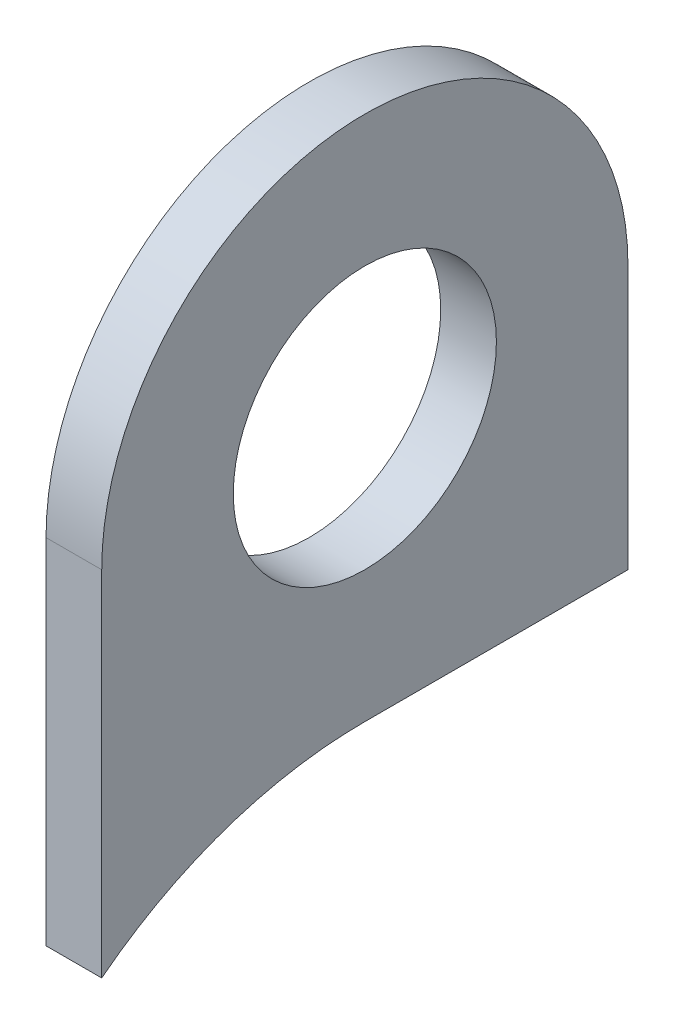
ISO-10303-21;
HEADER;
FILE_DESCRIPTION(('STEP AP214'),'2;1');
FILE_NAME('part.step','',(''),(''),'','','');
FILE_SCHEMA(('AUTOMOTIVE_DESIGN { 1 0 10303 214 1 1 1 1 }'));
ENDSEC;
DATA;
#1=APPLICATION_CONTEXT('core data for automotive mechanical design processes');
#2=APPLICATION_PROTOCOL_DEFINITION('international standard','automotive_design',2000,#1);
#3=PRODUCT_CONTEXT('',#1,'mechanical');
#4=PRODUCT('Part','Part','',(#3));
#5=PRODUCT_RELATED_PRODUCT_CATEGORY('part','',(#4));
#6=PRODUCT_DEFINITION_FORMATION('','',#4);
#7=PRODUCT_DEFINITION_CONTEXT('part definition',#1,'design');
#8=PRODUCT_DEFINITION('design','',#6,#7);
#9=PRODUCT_DEFINITION_SHAPE('','',#8);
#10=(LENGTH_UNIT() NAMED_UNIT(*) SI_UNIT(.MILLI.,.METRE.));
#11=(NAMED_UNIT(*) PLANE_ANGLE_UNIT() SI_UNIT($,.RADIAN.));
#12=(NAMED_UNIT(*) SI_UNIT($,.STERADIAN.) SOLID_ANGLE_UNIT());
#13=UNCERTAINTY_MEASURE_WITH_UNIT(LENGTH_MEASURE(1.E-05),#10,'distance_accuracy_value','');
#14=(GEOMETRIC_REPRESENTATION_CONTEXT(3) GLOBAL_UNCERTAINTY_ASSIGNED_CONTEXT((#13)) GLOBAL_UNIT_ASSIGNED_CONTEXT((#10,
#11,#12)) REPRESENTATION_CONTEXT('',''));
#15=CARTESIAN_POINT('',(0.,0.,0.));
#16=DIRECTION('',(0.,0.,1.));
#17=DIRECTION('',(1.,0.,0.));
#18=AXIS2_PLACEMENT_3D('',#15,#16,#17);
#19=CARTESIAN_POINT('',(6.35,-97.6,0.));
#20=DIRECTION('',(1.,0.,0.));
#21=DIRECTION('',(0.,0.,-1.));
#22=AXIS2_PLACEMENT_3D('',#19,#20,#21);
#23=PLANE('',#22);
#24=CARTESIAN_POINT('',(6.35,-97.6,0.));
#25=DIRECTION('',(-1.,0.,0.));
#26=DIRECTION('',(0.,0.,-1.));
#27=AXIS2_PLACEMENT_3D('',#24,#25,#26);
#28=CIRCLE('',#27,97.6);
#29=CARTESIAN_POINT('',(6.35,-20.6210418360965,60.));
#30=VERTEX_POINT('',#29);
#31=CARTESIAN_POINT('',(6.35,0.,0.));
#32=VERTEX_POINT('',#31);
#33=EDGE_CURVE('E123',#30,#32,#28,.T.);
#34=ORIENTED_EDGE('',*,*,#33,.T.);
#35=DIRECTION('',(0.,0.,-1.));
#36=VECTOR('',#35,1.);
#37=CARTESIAN_POINT('',(6.35,0.,0.));
#38=LINE('',#37,#36);
#39=CARTESIAN_POINT('',(6.35,0.,-60.));
#40=VERTEX_POINT('',#39);
#41=EDGE_CURVE('E86',#32,#40,#38,.T.);
#42=ORIENTED_EDGE('',*,*,#41,.T.);
#43=DIRECTION('',(0.,1.,0.));
#44=VECTOR('',#43,1.);
#45=CARTESIAN_POINT('',(6.35,0.,-60.));
#46=LINE('',#45,#44);
#47=CARTESIAN_POINT('',(6.35,60.,-60.));
#48=VERTEX_POINT('',#47);
#49=EDGE_CURVE('E90',#40,#48,#46,.T.);
#50=ORIENTED_EDGE('',*,*,#49,.T.);
#51=CARTESIAN_POINT('',(6.35,60.,0.));
#52=DIRECTION('',(1.,0.,0.));
#53=DIRECTION('',(0.,0.,-1.));
#54=AXIS2_PLACEMENT_3D('',#51,#52,#53);
#55=CIRCLE('',#54,60.);
#56=CARTESIAN_POINT('',(6.35,60.,60.));
#57=VERTEX_POINT('',#56);
#58=EDGE_CURVE('E94',#48,#57,#55,.T.);
#59=ORIENTED_EDGE('',*,*,#58,.T.);
#60=DIRECTION('',(0.,-1.,0.));
#61=VECTOR('',#60,1.);
#62=CARTESIAN_POINT('',(6.35,0.,60.));
#63=LINE('',#62,#61);
#64=EDGE_CURVE('E54',#57,#30,#63,.T.);
#65=ORIENTED_EDGE('',*,*,#64,.T.);
#66=EDGE_LOOP('',(#34,#42,#50,#59,#65));
#67=FACE_BOUND('',#66,.T.);
#68=CARTESIAN_POINT('',(6.35,60.,0.));
#69=DIRECTION('',(1.,0.,0.));
#70=DIRECTION('',(0.,0.,-1.));
#71=AXIS2_PLACEMENT_3D('',#68,#69,#70);
#72=CIRCLE('',#71,30.);
#73=CARTESIAN_POINT('',(6.35,60.,-30.));
#74=VERTEX_POINT('',#73);
#75=EDGE_CURVE('E117',#74,#74,#72,.T.);
#76=ORIENTED_EDGE('',*,*,#75,.F.);
#77=EDGE_LOOP('',(#76));
#78=FACE_BOUND('',#77,.T.);
#79=ADVANCED_FACE('F37',(#67,#78),#23,.T.);
#80=CARTESIAN_POINT('',(-6.35,-97.6,0.));
#81=DIRECTION('',(1.,0.,0.));
#82=DIRECTION('',(0.,0.,-1.));
#83=AXIS2_PLACEMENT_3D('',#80,#81,#82);
#84=PLANE('',#83);
#85=CARTESIAN_POINT('',(-6.35,-97.6,0.));
#86=DIRECTION('',(-1.,0.,0.));
#87=DIRECTION('',(0.,0.,-1.));
#88=AXIS2_PLACEMENT_3D('',#85,#86,#87);
#89=CIRCLE('',#88,97.6);
#90=CARTESIAN_POINT('',(-6.35,-20.6210418360965,60.));
#91=VERTEX_POINT('',#90);
#92=CARTESIAN_POINT('',(-6.35,0.,0.));
#93=VERTEX_POINT('',#92);
#94=EDGE_CURVE('E113',#91,#93,#89,.T.);
#95=ORIENTED_EDGE('',*,*,#94,.F.);
#96=DIRECTION('',(0.,-1.,0.));
#97=VECTOR('',#96,1.);
#98=CARTESIAN_POINT('',(-6.35,0.,60.));
#99=LINE('',#98,#97);
#100=CARTESIAN_POINT('',(-6.35,60.,60.));
#101=VERTEX_POINT('',#100);
#102=EDGE_CURVE('E74',#101,#91,#99,.T.);
#103=ORIENTED_EDGE('',*,*,#102,.F.);
#104=CARTESIAN_POINT('',(-6.35,60.,0.));
#105=DIRECTION('',(1.,0.,0.));
#106=DIRECTION('',(0.,0.,-1.));
#107=AXIS2_PLACEMENT_3D('',#104,#105,#106);
#108=CIRCLE('',#107,60.);
#109=CARTESIAN_POINT('',(-6.35,60.,-60.));
#110=VERTEX_POINT('',#109);
#111=EDGE_CURVE('E120',#110,#101,#108,.T.);
#112=ORIENTED_EDGE('',*,*,#111,.F.);
#113=DIRECTION('',(0.,1.,0.));
#114=VECTOR('',#113,1.);
#115=CARTESIAN_POINT('',(-6.35,0.,-60.));
#116=LINE('',#115,#114);
#117=CARTESIAN_POINT('',(-6.35,0.,-60.));
#118=VERTEX_POINT('',#117);
#119=EDGE_CURVE('E103',#118,#110,#116,.T.);
#120=ORIENTED_EDGE('',*,*,#119,.F.);
#121=DIRECTION('',(0.,0.,-1.));
#122=VECTOR('',#121,1.);
#123=CARTESIAN_POINT('',(-6.35,0.,0.));
#124=LINE('',#123,#122);
#125=EDGE_CURVE('E116',#93,#118,#124,.T.);
#126=ORIENTED_EDGE('',*,*,#125,.F.);
#127=EDGE_LOOP('',(#95,#103,#112,#120,#126));
#128=FACE_BOUND('',#127,.T.);
#129=CARTESIAN_POINT('',(-6.35,60.,0.));
#130=DIRECTION('',(1.,0.,0.));
#131=DIRECTION('',(0.,0.,-1.));
#132=AXIS2_PLACEMENT_3D('',#129,#130,#131);
#133=CIRCLE('',#132,30.);
#134=CARTESIAN_POINT('',(-6.35,60.,-30.));
#135=VERTEX_POINT('',#134);
#136=EDGE_CURVE('E133',#135,#135,#133,.T.);
#137=ORIENTED_EDGE('',*,*,#136,.T.);
#138=EDGE_LOOP('',(#137));
#139=FACE_BOUND('',#138,.T.);
#140=ADVANCED_FACE('F125',(#128,#139),#84,.F.);
#141=CARTESIAN_POINT('',(6.35,-97.6,0.));
#142=DIRECTION('',(-1.,0.,0.));
#143=DIRECTION('',(0.,0.,1.));
#144=AXIS2_PLACEMENT_3D('',#141,#142,#143);
#145=CYLINDRICAL_SURFACE('',#144,97.6);
#146=ORIENTED_EDGE('',*,*,#94,.T.);
#147=DIRECTION('',(-1.,0.,0.));
#148=VECTOR('',#147,1.);
#149=CARTESIAN_POINT('',(6.35,0.,0.));
#150=LINE('',#149,#148);
#151=EDGE_CURVE('E11',#32,#93,#150,.T.);
#152=ORIENTED_EDGE('',*,*,#151,.F.);
#153=ORIENTED_EDGE('',*,*,#33,.F.);
#154=DIRECTION('',(-1.,0.,0.));
#155=VECTOR('',#154,1.);
#156=CARTESIAN_POINT('',(6.35,-20.6210418360965,60.));
#157=LINE('',#156,#155);
#158=EDGE_CURVE('E109',#30,#91,#157,.T.);
#159=ORIENTED_EDGE('',*,*,#158,.T.);
#160=EDGE_LOOP('',(#146,#152,#153,#159));
#161=FACE_BOUND('',#160,.T.);
#162=ADVANCED_FACE('F39',(#161),#145,.F.);
#163=CARTESIAN_POINT('',(6.35,0.,0.));
#164=DIRECTION('',(0.,1.,0.));
#165=DIRECTION('',(0.,0.,1.));
#166=AXIS2_PLACEMENT_3D('',#163,#164,#165);
#167=PLANE('',#166);
#168=ORIENTED_EDGE('',*,*,#125,.T.);
#169=DIRECTION('',(-1.,0.,0.));
#170=VECTOR('',#169,1.);
#171=CARTESIAN_POINT('',(6.35,0.,-60.));
#172=LINE('',#171,#170);
#173=EDGE_CURVE('E46',#40,#118,#172,.T.);
#174=ORIENTED_EDGE('',*,*,#173,.F.);
#175=ORIENTED_EDGE('',*,*,#41,.F.);
#176=ORIENTED_EDGE('',*,*,#151,.T.);
#177=EDGE_LOOP('',(#168,#174,#175,#176));
#178=FACE_BOUND('',#177,.T.);
#179=ADVANCED_FACE('F154',(#178),#167,.F.);
#180=CARTESIAN_POINT('',(6.35,0.,-60.));
#181=DIRECTION('',(0.,0.,1.));
#182=DIRECTION('',(1.,0.,0.));
#183=AXIS2_PLACEMENT_3D('',#180,#181,#182);
#184=PLANE('',#183);
#185=ORIENTED_EDGE('',*,*,#119,.T.);
#186=DIRECTION('',(-1.,0.,0.));
#187=VECTOR('',#186,1.);
#188=CARTESIAN_POINT('',(6.35,60.,-60.));
#189=LINE('',#188,#187);
#190=EDGE_CURVE('E100',#48,#110,#189,.T.);
#191=ORIENTED_EDGE('',*,*,#190,.F.);
#192=ORIENTED_EDGE('',*,*,#49,.F.);
#193=ORIENTED_EDGE('',*,*,#173,.T.);
#194=EDGE_LOOP('',(#185,#191,#192,#193));
#195=FACE_BOUND('',#194,.T.);
#196=ADVANCED_FACE('F101',(#195),#184,.F.);
#197=CARTESIAN_POINT('',(6.35,60.,0.));
#198=DIRECTION('',(-1.,0.,0.));
#199=DIRECTION('',(0.,0.,1.));
#200=AXIS2_PLACEMENT_3D('',#197,#198,#199);
#201=CYLINDRICAL_SURFACE('',#200,60.);
#202=ORIENTED_EDGE('',*,*,#111,.T.);
#203=DIRECTION('',(-1.,0.,0.));
#204=VECTOR('',#203,1.);
#205=CARTESIAN_POINT('',(6.35,60.,60.));
#206=LINE('',#205,#204);
#207=EDGE_CURVE('E105',#57,#101,#206,.T.);
#208=ORIENTED_EDGE('',*,*,#207,.F.);
#209=ORIENTED_EDGE('',*,*,#58,.F.);
#210=ORIENTED_EDGE('',*,*,#190,.T.);
#211=EDGE_LOOP('',(#202,#208,#209,#210));
#212=FACE_BOUND('',#211,.T.);
#213=ADVANCED_FACE('F107',(#212),#201,.T.);
#214=CARTESIAN_POINT('',(6.35,0.,60.));
#215=DIRECTION('',(0.,0.,-1.));
#216=DIRECTION('',(-1.,0.,0.));
#217=AXIS2_PLACEMENT_3D('',#214,#215,#216);
#218=PLANE('',#217);
#219=ORIENTED_EDGE('',*,*,#102,.T.);
#220=ORIENTED_EDGE('',*,*,#158,.F.);
#221=ORIENTED_EDGE('',*,*,#64,.F.);
#222=ORIENTED_EDGE('',*,*,#207,.T.);
#223=EDGE_LOOP('',(#219,#220,#221,#222));
#224=FACE_BOUND('',#223,.T.);
#225=ADVANCED_FACE('F127',(#224),#218,.F.);
#226=CARTESIAN_POINT('',(6.35,60.,0.));
#227=DIRECTION('',(-1.,0.,0.));
#228=DIRECTION('',(0.,0.,1.));
#229=AXIS2_PLACEMENT_3D('',#226,#227,#228);
#230=CYLINDRICAL_SURFACE('',#229,30.);
#231=ORIENTED_EDGE('',*,*,#75,.T.);
#232=EDGE_LOOP('',(#231));
#233=FACE_BOUND('',#232,.T.);
#234=ORIENTED_EDGE('',*,*,#136,.F.);
#235=EDGE_LOOP('',(#234));
#236=FACE_BOUND('',#235,.T.);
#237=ADVANCED_FACE('F139',(#233,#236),#230,.F.);
#238=CLOSED_SHELL('',(#79,#140,#162,#179,#196,#213,#225,#237));
#239=MANIFOLD_SOLID_BREP('B2',#238);
#240=ADVANCED_BREP_SHAPE_REPRESENTATION('',(#18,#239),#14);
#241=SHAPE_DEFINITION_REPRESENTATION(#9,#240);
ENDSEC;
END-ISO-10303-21;
